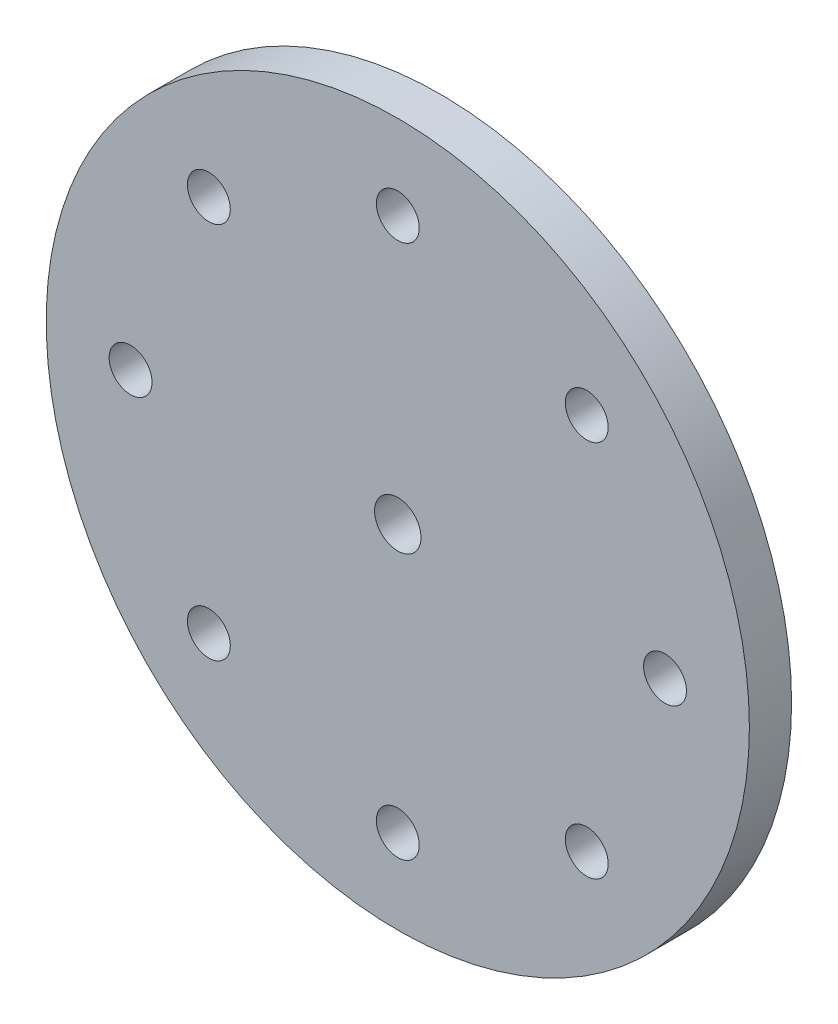
ISO-10303-21;
HEADER;
FILE_DESCRIPTION(('STEP AP214'),'2;1');
FILE_NAME('part.step','',(''),(''),'','','');
FILE_SCHEMA(('AUTOMOTIVE_DESIGN { 1 0 10303 214 1 1 1 1 }'));
ENDSEC;
DATA;
#1=APPLICATION_CONTEXT('core data for automotive mechanical design processes');
#2=APPLICATION_PROTOCOL_DEFINITION('international standard','automotive_design',2000,#1);
#3=PRODUCT_CONTEXT('',#1,'mechanical');
#4=PRODUCT('Part','Part','',(#3));
#5=PRODUCT_RELATED_PRODUCT_CATEGORY('part','',(#4));
#6=PRODUCT_DEFINITION_FORMATION('','',#4);
#7=PRODUCT_DEFINITION_CONTEXT('part definition',#1,'design');
#8=PRODUCT_DEFINITION('design','',#6,#7);
#9=PRODUCT_DEFINITION_SHAPE('','',#8);
#10=(LENGTH_UNIT() NAMED_UNIT(*) SI_UNIT(.MILLI.,.METRE.));
#11=(NAMED_UNIT(*) PLANE_ANGLE_UNIT() SI_UNIT($,.RADIAN.));
#12=(NAMED_UNIT(*) SI_UNIT($,.STERADIAN.) SOLID_ANGLE_UNIT());
#13=UNCERTAINTY_MEASURE_WITH_UNIT(LENGTH_MEASURE(1.E-05),#10,'distance_accuracy_value','');
#14=(GEOMETRIC_REPRESENTATION_CONTEXT(3) GLOBAL_UNCERTAINTY_ASSIGNED_CONTEXT((#13)) GLOBAL_UNIT_ASSIGNED_CONTEXT((#10,
#11,#12)) REPRESENTATION_CONTEXT('',''));
#15=CARTESIAN_POINT('',(0.,0.,0.));
#16=DIRECTION('',(0.,0.,1.));
#17=DIRECTION('',(1.,0.,0.));
#18=AXIS2_PLACEMENT_3D('',#15,#16,#17);
#19=CARTESIAN_POINT('',(0.,0.,3.));
#20=DIRECTION('',(0.,0.,1.));
#21=DIRECTION('',(1.,0.,0.));
#22=AXIS2_PLACEMENT_3D('',#19,#20,#21);
#23=PLANE('',#22);
#24=CARTESIAN_POINT('',(0.,0.,3.));
#25=DIRECTION('',(0.,0.,-1.));
#26=DIRECTION('',(-1.,0.,0.));
#27=AXIS2_PLACEMENT_3D('',#24,#25,#26);
#28=CIRCLE('',#27,1.65);
#29=CARTESIAN_POINT('',(-1.65,0.,3.));
#30=VERTEX_POINT('',#29);
#31=EDGE_CURVE('E86',#30,#30,#28,.T.);
#32=ORIENTED_EDGE('',*,*,#31,.T.);
#33=EDGE_LOOP('',(#32));
#34=FACE_BOUND('',#33,.T.);
#35=CARTESIAN_POINT('',(-19.,0.,3.));
#36=DIRECTION('',(0.,0.,1.));
#37=DIRECTION('',(1.,0.,0.));
#38=AXIS2_PLACEMENT_3D('',#35,#36,#37);
#39=CIRCLE('',#38,1.525);
#40=CARTESIAN_POINT('',(-17.475,0.,3.));
#41=VERTEX_POINT('',#40);
#42=EDGE_CURVE('E95',#41,#41,#39,.T.);
#43=ORIENTED_EDGE('',*,*,#42,.F.);
#44=EDGE_LOOP('',(#43));
#45=FACE_BOUND('',#44,.T.);
#46=CARTESIAN_POINT('',(0.,-19.,3.));
#47=DIRECTION('',(0.,0.,1.));
#48=DIRECTION('',(1.,0.,0.));
#49=AXIS2_PLACEMENT_3D('',#46,#47,#48);
#50=CIRCLE('',#49,1.525);
#51=CARTESIAN_POINT('',(1.525,-19.,3.));
#52=VERTEX_POINT('',#51);
#53=EDGE_CURVE('E111',#52,#52,#50,.T.);
#54=ORIENTED_EDGE('',*,*,#53,.F.);
#55=EDGE_LOOP('',(#54));
#56=FACE_BOUND('',#55,.T.);
#57=CARTESIAN_POINT('',(19.,0.,3.));
#58=DIRECTION('',(0.,0.,1.));
#59=DIRECTION('',(1.,0.,0.));
#60=AXIS2_PLACEMENT_3D('',#57,#58,#59);
#61=CIRCLE('',#60,1.525);
#62=CARTESIAN_POINT('',(20.525,0.,3.));
#63=VERTEX_POINT('',#62);
#64=EDGE_CURVE('E127',#63,#63,#61,.T.);
#65=ORIENTED_EDGE('',*,*,#64,.F.);
#66=EDGE_LOOP('',(#65));
#67=FACE_BOUND('',#66,.T.);
#68=CARTESIAN_POINT('',(0.,19.,3.));
#69=DIRECTION('',(0.,0.,1.));
#70=DIRECTION('',(1.,0.,0.));
#71=AXIS2_PLACEMENT_3D('',#68,#69,#70);
#72=CIRCLE('',#71,1.525);
#73=CARTESIAN_POINT('',(1.525,19.,3.));
#74=VERTEX_POINT('',#73);
#75=EDGE_CURVE('E62',#74,#74,#72,.T.);
#76=ORIENTED_EDGE('',*,*,#75,.F.);
#77=EDGE_LOOP('',(#76));
#78=FACE_BOUND('',#77,.T.);
#79=CARTESIAN_POINT('',(0.,0.,3.));
#80=DIRECTION('',(0.,0.,1.));
#81=DIRECTION('',(1.,0.,0.));
#82=AXIS2_PLACEMENT_3D('',#79,#80,#81);
#83=CIRCLE('',#82,25.);
#84=CARTESIAN_POINT('',(25.,0.,3.));
#85=VERTEX_POINT('',#84);
#86=EDGE_CURVE('E11',#85,#85,#83,.T.);
#87=ORIENTED_EDGE('',*,*,#86,.T.);
#88=EDGE_LOOP('',(#87));
#89=FACE_BOUND('',#88,.T.);
#90=CARTESIAN_POINT('',(13.4350288425444,13.4350288425444,3.));
#91=DIRECTION('',(0.,0.,1.));
#92=DIRECTION('',(1.,0.,0.));
#93=AXIS2_PLACEMENT_3D('',#90,#91,#92);
#94=CIRCLE('',#93,1.525);
#95=CARTESIAN_POINT('',(14.9600288425444,13.4350288425444,3.));
#96=VERTEX_POINT('',#95);
#97=EDGE_CURVE('E135',#96,#96,#94,.T.);
#98=ORIENTED_EDGE('',*,*,#97,.F.);
#99=EDGE_LOOP('',(#98));
#100=FACE_BOUND('',#99,.T.);
#101=CARTESIAN_POINT('',(13.4350288425444,-13.4350288425444,3.));
#102=DIRECTION('',(0.,0.,1.));
#103=DIRECTION('',(1.,0.,0.));
#104=AXIS2_PLACEMENT_3D('',#101,#102,#103);
#105=CIRCLE('',#104,1.525);
#106=CARTESIAN_POINT('',(14.9600288425444,-13.4350288425444,3.));
#107=VERTEX_POINT('',#106);
#108=EDGE_CURVE('E119',#107,#107,#105,.T.);
#109=ORIENTED_EDGE('',*,*,#108,.F.);
#110=EDGE_LOOP('',(#109));
#111=FACE_BOUND('',#110,.T.);
#112=CARTESIAN_POINT('',(-13.4350288425444,-13.4350288425444,3.));
#113=DIRECTION('',(0.,0.,1.));
#114=DIRECTION('',(1.,0.,0.));
#115=AXIS2_PLACEMENT_3D('',#112,#113,#114);
#116=CIRCLE('',#115,1.525);
#117=CARTESIAN_POINT('',(-11.9100288425444,-13.4350288425444,3.));
#118=VERTEX_POINT('',#117);
#119=EDGE_CURVE('E103',#118,#118,#116,.T.);
#120=ORIENTED_EDGE('',*,*,#119,.F.);
#121=EDGE_LOOP('',(#120));
#122=FACE_BOUND('',#121,.T.);
#123=CARTESIAN_POINT('',(-13.4350288425444,13.4350288425444,3.));
#124=DIRECTION('',(0.,0.,1.));
#125=DIRECTION('',(1.,0.,0.));
#126=AXIS2_PLACEMENT_3D('',#123,#124,#125);
#127=CIRCLE('',#126,1.525);
#128=CARTESIAN_POINT('',(-11.9100288425444,13.4350288425444,3.));
#129=VERTEX_POINT('',#128);
#130=EDGE_CURVE('E77',#129,#129,#127,.T.);
#131=ORIENTED_EDGE('',*,*,#130,.F.);
#132=EDGE_LOOP('',(#131));
#133=FACE_BOUND('',#132,.T.);
#134=ADVANCED_FACE('F47',(#34,#45,#56,#67,#78,#89,#100,#111,#122,#133),#23,.T.);
#135=CARTESIAN_POINT('',(0.,0.,0.));
#136=DIRECTION('',(0.,0.,1.));
#137=DIRECTION('',(1.,0.,0.));
#138=AXIS2_PLACEMENT_3D('',#135,#136,#137);
#139=PLANE('',#138);
#140=CARTESIAN_POINT('',(0.,0.,0.));
#141=DIRECTION('',(0.,0.,1.));
#142=DIRECTION('',(1.,0.,0.));
#143=AXIS2_PLACEMENT_3D('',#140,#141,#142);
#144=CIRCLE('',#143,5.2);
#145=CARTESIAN_POINT('',(5.2,0.,0.));
#146=VERTEX_POINT('',#145);
#147=EDGE_CURVE('E80',#146,#146,#144,.T.);
#148=ORIENTED_EDGE('',*,*,#147,.T.);
#149=EDGE_LOOP('',(#148));
#150=FACE_BOUND('',#149,.T.);
#151=CARTESIAN_POINT('',(0.,0.,0.));
#152=DIRECTION('',(0.,0.,1.));
#153=DIRECTION('',(1.,0.,0.));
#154=AXIS2_PLACEMENT_3D('',#151,#152,#153);
#155=CIRCLE('',#154,25.);
#156=CARTESIAN_POINT('',(25.,0.,0.));
#157=VERTEX_POINT('',#156);
#158=EDGE_CURVE('E56',#157,#157,#155,.T.);
#159=ORIENTED_EDGE('',*,*,#158,.F.);
#160=EDGE_LOOP('',(#159));
#161=FACE_BOUND('',#160,.T.);
#162=CARTESIAN_POINT('',(0.,19.,0.));
#163=DIRECTION('',(0.,0.,1.));
#164=DIRECTION('',(1.,0.,0.));
#165=AXIS2_PLACEMENT_3D('',#162,#163,#164);
#166=CIRCLE('',#165,1.525);
#167=CARTESIAN_POINT('',(1.525,19.,0.));
#168=VERTEX_POINT('',#167);
#169=EDGE_CURVE('E65',#168,#168,#166,.T.);
#170=ORIENTED_EDGE('',*,*,#169,.T.);
#171=EDGE_LOOP('',(#170));
#172=FACE_BOUND('',#171,.T.);
#173=CARTESIAN_POINT('',(13.4350288425444,13.4350288425444,0.));
#174=DIRECTION('',(0.,0.,1.));
#175=DIRECTION('',(1.,0.,0.));
#176=AXIS2_PLACEMENT_3D('',#173,#174,#175);
#177=CIRCLE('',#176,1.525);
#178=CARTESIAN_POINT('',(14.9600288425444,13.4350288425444,0.));
#179=VERTEX_POINT('',#178);
#180=EDGE_CURVE('E131',#179,#179,#177,.T.);
#181=ORIENTED_EDGE('',*,*,#180,.T.);
#182=EDGE_LOOP('',(#181));
#183=FACE_BOUND('',#182,.T.);
#184=CARTESIAN_POINT('',(19.,0.,0.));
#185=DIRECTION('',(0.,0.,1.));
#186=DIRECTION('',(1.,0.,0.));
#187=AXIS2_PLACEMENT_3D('',#184,#185,#186);
#188=CIRCLE('',#187,1.525);
#189=CARTESIAN_POINT('',(20.525,0.,0.));
#190=VERTEX_POINT('',#189);
#191=EDGE_CURVE('E123',#190,#190,#188,.T.);
#192=ORIENTED_EDGE('',*,*,#191,.T.);
#193=EDGE_LOOP('',(#192));
#194=FACE_BOUND('',#193,.T.);
#195=CARTESIAN_POINT('',(13.4350288425444,-13.4350288425444,0.));
#196=DIRECTION('',(0.,0.,1.));
#197=DIRECTION('',(1.,0.,0.));
#198=AXIS2_PLACEMENT_3D('',#195,#196,#197);
#199=CIRCLE('',#198,1.525);
#200=CARTESIAN_POINT('',(14.9600288425444,-13.4350288425444,0.));
#201=VERTEX_POINT('',#200);
#202=EDGE_CURVE('E115',#201,#201,#199,.T.);
#203=ORIENTED_EDGE('',*,*,#202,.T.);
#204=EDGE_LOOP('',(#203));
#205=FACE_BOUND('',#204,.T.);
#206=CARTESIAN_POINT('',(0.,-19.,0.));
#207=DIRECTION('',(0.,0.,1.));
#208=DIRECTION('',(1.,0.,0.));
#209=AXIS2_PLACEMENT_3D('',#206,#207,#208);
#210=CIRCLE('',#209,1.525);
#211=CARTESIAN_POINT('',(1.525,-19.,0.));
#212=VERTEX_POINT('',#211);
#213=EDGE_CURVE('E107',#212,#212,#210,.T.);
#214=ORIENTED_EDGE('',*,*,#213,.T.);
#215=EDGE_LOOP('',(#214));
#216=FACE_BOUND('',#215,.T.);
#217=CARTESIAN_POINT('',(-13.4350288425444,-13.4350288425444,0.));
#218=DIRECTION('',(0.,0.,1.));
#219=DIRECTION('',(1.,0.,0.));
#220=AXIS2_PLACEMENT_3D('',#217,#218,#219);
#221=CIRCLE('',#220,1.525);
#222=CARTESIAN_POINT('',(-11.9100288425444,-13.4350288425444,0.));
#223=VERTEX_POINT('',#222);
#224=EDGE_CURVE('E99',#223,#223,#221,.T.);
#225=ORIENTED_EDGE('',*,*,#224,.T.);
#226=EDGE_LOOP('',(#225));
#227=FACE_BOUND('',#226,.T.);
#228=CARTESIAN_POINT('',(-19.,0.,0.));
#229=DIRECTION('',(0.,0.,1.));
#230=DIRECTION('',(1.,0.,0.));
#231=AXIS2_PLACEMENT_3D('',#228,#229,#230);
#232=CIRCLE('',#231,1.525);
#233=CARTESIAN_POINT('',(-17.475,0.,0.));
#234=VERTEX_POINT('',#233);
#235=EDGE_CURVE('E93',#234,#234,#232,.T.);
#236=ORIENTED_EDGE('',*,*,#235,.T.);
#237=EDGE_LOOP('',(#236));
#238=FACE_BOUND('',#237,.T.);
#239=CARTESIAN_POINT('',(-13.4350288425444,13.4350288425444,0.));
#240=DIRECTION('',(0.,0.,1.));
#241=DIRECTION('',(1.,0.,0.));
#242=AXIS2_PLACEMENT_3D('',#239,#240,#241);
#243=CIRCLE('',#242,1.525);
#244=CARTESIAN_POINT('',(-11.9100288425444,13.4350288425444,0.));
#245=VERTEX_POINT('',#244);
#246=EDGE_CURVE('E70',#245,#245,#243,.T.);
#247=ORIENTED_EDGE('',*,*,#246,.T.);
#248=EDGE_LOOP('',(#247));
#249=FACE_BOUND('',#248,.T.);
#250=ADVANCED_FACE('F149',(#150,#161,#172,#183,#194,#205,#216,#227,#238,#249),#139,.F.);
#251=CARTESIAN_POINT('',(0.,0.,3.));
#252=DIRECTION('',(0.,0.,-1.));
#253=DIRECTION('',(-1.,0.,0.));
#254=AXIS2_PLACEMENT_3D('',#251,#252,#253);
#255=CYLINDRICAL_SURFACE('',#254,25.);
#256=ORIENTED_EDGE('',*,*,#86,.F.);
#257=EDGE_LOOP('',(#256));
#258=FACE_BOUND('',#257,.T.);
#259=ORIENTED_EDGE('',*,*,#158,.T.);
#260=EDGE_LOOP('',(#259));
#261=FACE_BOUND('',#260,.T.);
#262=ADVANCED_FACE('F49',(#258,#261),#255,.T.);
#263=CARTESIAN_POINT('',(0.,19.,3.));
#264=DIRECTION('',(0.,0.,-1.));
#265=DIRECTION('',(-1.,0.,0.));
#266=AXIS2_PLACEMENT_3D('',#263,#264,#265);
#267=CYLINDRICAL_SURFACE('',#266,1.525);
#268=ORIENTED_EDGE('',*,*,#75,.T.);
#269=EDGE_LOOP('',(#268));
#270=FACE_BOUND('',#269,.T.);
#271=ORIENTED_EDGE('',*,*,#169,.F.);
#272=EDGE_LOOP('',(#271));
#273=FACE_BOUND('',#272,.T.);
#274=ADVANCED_FACE('F152',(#270,#273),#267,.F.);
#275=CARTESIAN_POINT('',(13.4350288425444,13.4350288425444,3.));
#276=DIRECTION('',(0.,0.,-1.));
#277=DIRECTION('',(-1.,0.,0.));
#278=AXIS2_PLACEMENT_3D('',#275,#276,#277);
#279=CYLINDRICAL_SURFACE('',#278,1.525);
#280=ORIENTED_EDGE('',*,*,#97,.T.);
#281=EDGE_LOOP('',(#280));
#282=FACE_BOUND('',#281,.T.);
#283=ORIENTED_EDGE('',*,*,#180,.F.);
#284=EDGE_LOOP('',(#283));
#285=FACE_BOUND('',#284,.T.);
#286=ADVANCED_FACE('F154',(#282,#285),#279,.F.);
#287=CARTESIAN_POINT('',(19.,0.,3.));
#288=DIRECTION('',(0.,0.,-1.));
#289=DIRECTION('',(-1.,0.,0.));
#290=AXIS2_PLACEMENT_3D('',#287,#288,#289);
#291=CYLINDRICAL_SURFACE('',#290,1.525);
#292=ORIENTED_EDGE('',*,*,#64,.T.);
#293=EDGE_LOOP('',(#292));
#294=FACE_BOUND('',#293,.T.);
#295=ORIENTED_EDGE('',*,*,#191,.F.);
#296=EDGE_LOOP('',(#295));
#297=FACE_BOUND('',#296,.T.);
#298=ADVANCED_FACE('F160',(#294,#297),#291,.F.);
#299=CARTESIAN_POINT('',(13.4350288425444,-13.4350288425444,3.));
#300=DIRECTION('',(0.,0.,-1.));
#301=DIRECTION('',(-1.,0.,0.));
#302=AXIS2_PLACEMENT_3D('',#299,#300,#301);
#303=CYLINDRICAL_SURFACE('',#302,1.525);
#304=ORIENTED_EDGE('',*,*,#108,.T.);
#305=EDGE_LOOP('',(#304));
#306=FACE_BOUND('',#305,.T.);
#307=ORIENTED_EDGE('',*,*,#202,.F.);
#308=EDGE_LOOP('',(#307));
#309=FACE_BOUND('',#308,.T.);
#310=ADVANCED_FACE('F215',(#306,#309),#303,.F.);
#311=CARTESIAN_POINT('',(0.,-19.,3.));
#312=DIRECTION('',(0.,0.,-1.));
#313=DIRECTION('',(-1.,0.,0.));
#314=AXIS2_PLACEMENT_3D('',#311,#312,#313);
#315=CYLINDRICAL_SURFACE('',#314,1.525);
#316=ORIENTED_EDGE('',*,*,#53,.T.);
#317=EDGE_LOOP('',(#316));
#318=FACE_BOUND('',#317,.T.);
#319=ORIENTED_EDGE('',*,*,#213,.F.);
#320=EDGE_LOOP('',(#319));
#321=FACE_BOUND('',#320,.T.);
#322=ADVANCED_FACE('F211',(#318,#321),#315,.F.);
#323=CARTESIAN_POINT('',(-13.4350288425444,-13.4350288425444,3.));
#324=DIRECTION('',(0.,0.,-1.));
#325=DIRECTION('',(-1.,0.,0.));
#326=AXIS2_PLACEMENT_3D('',#323,#324,#325);
#327=CYLINDRICAL_SURFACE('',#326,1.525);
#328=ORIENTED_EDGE('',*,*,#119,.T.);
#329=EDGE_LOOP('',(#328));
#330=FACE_BOUND('',#329,.T.);
#331=ORIENTED_EDGE('',*,*,#224,.F.);
#332=EDGE_LOOP('',(#331));
#333=FACE_BOUND('',#332,.T.);
#334=ADVANCED_FACE('F203',(#330,#333),#327,.F.);
#335=CARTESIAN_POINT('',(-19.,0.,3.));
#336=DIRECTION('',(0.,0.,-1.));
#337=DIRECTION('',(-1.,0.,0.));
#338=AXIS2_PLACEMENT_3D('',#335,#336,#337);
#339=CYLINDRICAL_SURFACE('',#338,1.525);
#340=ORIENTED_EDGE('',*,*,#42,.T.);
#341=EDGE_LOOP('',(#340));
#342=FACE_BOUND('',#341,.T.);
#343=ORIENTED_EDGE('',*,*,#235,.F.);
#344=EDGE_LOOP('',(#343));
#345=FACE_BOUND('',#344,.T.);
#346=ADVANCED_FACE('F193',(#342,#345),#339,.F.);
#347=CARTESIAN_POINT('',(-13.4350288425444,13.4350288425444,3.));
#348=DIRECTION('',(0.,0.,-1.));
#349=DIRECTION('',(-1.,0.,0.));
#350=AXIS2_PLACEMENT_3D('',#347,#348,#349);
#351=CYLINDRICAL_SURFACE('',#350,1.525);
#352=ORIENTED_EDGE('',*,*,#130,.T.);
#353=EDGE_LOOP('',(#352));
#354=FACE_BOUND('',#353,.T.);
#355=ORIENTED_EDGE('',*,*,#246,.F.);
#356=EDGE_LOOP('',(#355));
#357=FACE_BOUND('',#356,.T.);
#358=ADVANCED_FACE('F189',(#354,#357),#351,.F.);
#359=CARTESIAN_POINT('',(0.,0.,-1.2));
#360=DIRECTION('',(0.,0.,1.));
#361=DIRECTION('',(1.,0.,0.));
#362=AXIS2_PLACEMENT_3D('',#359,#360,#361);
#363=CYLINDRICAL_SURFACE('',#362,5.2);
#364=CARTESIAN_POINT('',(0.,0.,-1.2));
#365=DIRECTION('',(0.,0.,1.));
#366=DIRECTION('',(1.,0.,0.));
#367=AXIS2_PLACEMENT_3D('',#364,#365,#366);
#368=CIRCLE('',#367,5.2);
#369=CARTESIAN_POINT('',(5.2,0.,-1.2));
#370=VERTEX_POINT('',#369);
#371=EDGE_CURVE('E71',#370,#370,#368,.T.);
#372=ORIENTED_EDGE('',*,*,#371,.T.);
#373=EDGE_LOOP('',(#372));
#374=FACE_BOUND('',#373,.T.);
#375=ORIENTED_EDGE('',*,*,#147,.F.);
#376=EDGE_LOOP('',(#375));
#377=FACE_BOUND('',#376,.T.);
#378=ADVANCED_FACE('F192',(#374,#377),#363,.T.);
#379=CARTESIAN_POINT('',(0.,0.,-1.2));
#380=DIRECTION('',(0.,0.,1.));
#381=DIRECTION('',(1.,0.,0.));
#382=AXIS2_PLACEMENT_3D('',#379,#380,#381);
#383=PLANE('',#382);
#384=CARTESIAN_POINT('',(0.,0.,-1.2));
#385=DIRECTION('',(0.,0.,1.));
#386=DIRECTION('',(1.,0.,0.));
#387=AXIS2_PLACEMENT_3D('',#384,#385,#386);
#388=CIRCLE('',#387,4.);
#389=CARTESIAN_POINT('',(4.,0.,-1.2));
#390=VERTEX_POINT('',#389);
#391=EDGE_CURVE('E67',#390,#390,#388,.F.);
#392=ORIENTED_EDGE('',*,*,#391,.F.);
#393=EDGE_LOOP('',(#392));
#394=FACE_BOUND('',#393,.T.);
#395=ORIENTED_EDGE('',*,*,#371,.F.);
#396=EDGE_LOOP('',(#395));
#397=FACE_BOUND('',#396,.T.);
#398=ADVANCED_FACE('F201',(#394,#397),#383,.F.);
#399=CARTESIAN_POINT('',(0.,0.,-11.3));
#400=DIRECTION('',(0.,0.,1.));
#401=DIRECTION('',(1.,0.,0.));
#402=AXIS2_PLACEMENT_3D('',#399,#400,#401);
#403=CYLINDRICAL_SURFACE('',#402,4.);
#404=CARTESIAN_POINT('',(0.,0.,-9.2));
#405=DIRECTION('',(0.,0.,1.));
#406=DIRECTION('',(1.,0.,0.));
#407=AXIS2_PLACEMENT_3D('',#404,#405,#406);
#408=CIRCLE('',#407,4.);
#409=CARTESIAN_POINT('',(4.,0.,-9.2));
#410=VERTEX_POINT('',#409);
#411=EDGE_CURVE('E342',#410,#410,#408,.F.);
#412=ORIENTED_EDGE('',*,*,#411,.F.);
#413=EDGE_LOOP('',(#412));
#414=FACE_BOUND('',#413,.T.);
#415=ORIENTED_EDGE('',*,*,#391,.T.);
#416=EDGE_LOOP('',(#415));
#417=FACE_BOUND('',#416,.T.);
#418=ADVANCED_FACE('F207',(#414,#417),#403,.T.);
#419=CARTESIAN_POINT('',(0.,0.,-11.3));
#420=DIRECTION('',(0.,0.,-1.));
#421=DIRECTION('',(-1.,0.,0.));
#422=AXIS2_PLACEMENT_3D('',#419,#420,#421);
#423=CYLINDRICAL_SURFACE('',#422,1.65);
#424=CARTESIAN_POINT('',(0.,0.,-9.2));
#425=DIRECTION('',(0.,0.,1.));
#426=DIRECTION('',(1.,0.,0.));
#427=AXIS2_PLACEMENT_3D('',#424,#425,#426);
#428=CIRCLE('',#427,1.65);
#429=CARTESIAN_POINT('',(1.65,0.,-9.2));
#430=VERTEX_POINT('',#429);
#431=EDGE_CURVE('E51',#430,#430,#428,.F.);
#432=ORIENTED_EDGE('',*,*,#431,.T.);
#433=EDGE_LOOP('',(#432));
#434=FACE_BOUND('',#433,.T.);
#435=ORIENTED_EDGE('',*,*,#31,.F.);
#436=EDGE_LOOP('',(#435));
#437=FACE_BOUND('',#436,.T.);
#438=ADVANCED_FACE('F304',(#434,#437),#423,.F.);
#439=CARTESIAN_POINT('',(-5.,-25.,-9.2));
#440=DIRECTION('',(0.,0.,1.));
#441=DIRECTION('',(1.,0.,0.));
#442=AXIS2_PLACEMENT_3D('',#439,#440,#441);
#443=PLANE('',#442);
#444=ORIENTED_EDGE('',*,*,#411,.T.);
#445=EDGE_LOOP('',(#444));
#446=FACE_BOUND('',#445,.T.);
#447=ORIENTED_EDGE('',*,*,#431,.F.);
#448=EDGE_LOOP('',(#447));
#449=FACE_BOUND('',#448,.T.);
#450=ADVANCED_FACE('F313',(#446,#449),#443,.F.);
#451=CLOSED_SHELL('',(#134,#250,#262,#274,#286,#298,#310,#322,#334,#346,#358,#378,#398,#418,
#438,#450));
#452=MANIFOLD_SOLID_BREP('B2',#451);
#453=ADVANCED_BREP_SHAPE_REPRESENTATION('',(#18,#452),#14);
#454=SHAPE_DEFINITION_REPRESENTATION(#9,#453);
ENDSEC;
END-ISO-10303-21;
